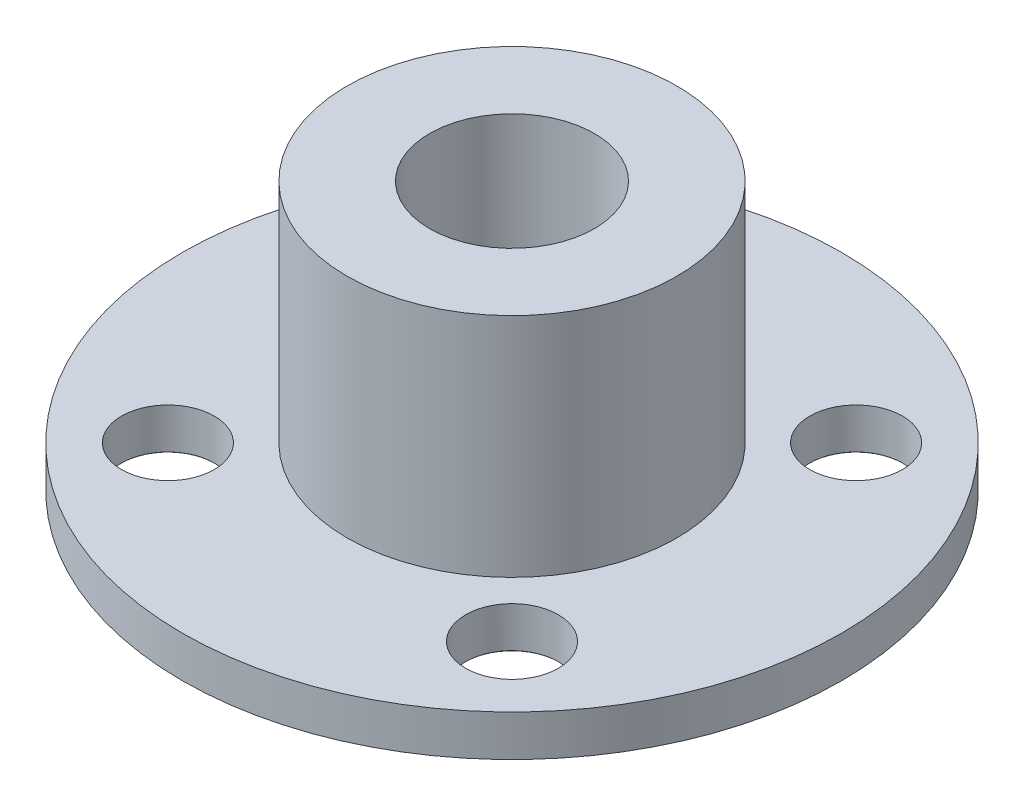
ISO-10303-21;
HEADER;
FILE_DESCRIPTION(('STEP AP214'),'2;1');
FILE_NAME('part.step','',(''),(''),'','','');
FILE_SCHEMA(('AUTOMOTIVE_DESIGN { 1 0 10303 214 1 1 1 1 }'));
ENDSEC;
DATA;
#1=APPLICATION_CONTEXT('core data for automotive mechanical design processes');
#2=APPLICATION_PROTOCOL_DEFINITION('international standard','automotive_design',2000,#1);
#3=PRODUCT_CONTEXT('',#1,'mechanical');
#4=PRODUCT('Part','Part','',(#3));
#5=PRODUCT_RELATED_PRODUCT_CATEGORY('part','',(#4));
#6=PRODUCT_DEFINITION_FORMATION('','',#4);
#7=PRODUCT_DEFINITION_CONTEXT('part definition',#1,'design');
#8=PRODUCT_DEFINITION('design','',#6,#7);
#9=PRODUCT_DEFINITION_SHAPE('','',#8);
#10=(LENGTH_UNIT() NAMED_UNIT(*) SI_UNIT(.MILLI.,.METRE.));
#11=(NAMED_UNIT(*) PLANE_ANGLE_UNIT() SI_UNIT($,.RADIAN.));
#12=(NAMED_UNIT(*) SI_UNIT($,.STERADIAN.) SOLID_ANGLE_UNIT());
#13=UNCERTAINTY_MEASURE_WITH_UNIT(LENGTH_MEASURE(1.E-05),#10,'distance_accuracy_value','');
#14=(GEOMETRIC_REPRESENTATION_CONTEXT(3) GLOBAL_UNCERTAINTY_ASSIGNED_CONTEXT((#13)) GLOBAL_UNIT_ASSIGNED_CONTEXT((#10,
#11,#12)) REPRESENTATION_CONTEXT('',''));
#15=CARTESIAN_POINT('',(0.,0.,0.));
#16=DIRECTION('',(0.,0.,1.));
#17=DIRECTION('',(1.,0.,0.));
#18=AXIS2_PLACEMENT_3D('',#15,#16,#17);
#19=CARTESIAN_POINT('',(0.,2.,0.));
#20=DIRECTION('',(0.,1.,0.));
#21=DIRECTION('',(0.,0.,1.));
#22=AXIS2_PLACEMENT_3D('',#19,#20,#21);
#23=PLANE('',#22);
#24=CARTESIAN_POINT('',(8.35,2.,-8.35));
#25=DIRECTION('',(0.,1.,0.));
#26=DIRECTION('',(0.,0.,1.));
#27=AXIS2_PLACEMENT_3D('',#24,#25,#26);
#28=CIRCLE('',#27,2.24999999999999);
#29=CARTESIAN_POINT('',(8.35,2.,-6.10000000000001));
#30=VERTEX_POINT('',#29);
#31=EDGE_CURVE('E49',#30,#30,#28,.T.);
#32=ORIENTED_EDGE('',*,*,#31,.F.);
#33=EDGE_LOOP('',(#32));
#34=FACE_BOUND('',#33,.T.);
#35=CARTESIAN_POINT('',(-8.35,2.,-8.35));
#36=DIRECTION('',(0.,1.,0.));
#37=DIRECTION('',(0.,0.,1.));
#38=AXIS2_PLACEMENT_3D('',#35,#36,#37);
#39=CIRCLE('',#38,2.24999999999999);
#40=CARTESIAN_POINT('',(-8.35,2.,-6.10000000000001));
#41=VERTEX_POINT('',#40);
#42=EDGE_CURVE('E72',#41,#41,#39,.T.);
#43=ORIENTED_EDGE('',*,*,#42,.F.);
#44=EDGE_LOOP('',(#43));
#45=FACE_BOUND('',#44,.T.);
#46=CARTESIAN_POINT('',(-8.35,2.,8.35));
#47=DIRECTION('',(0.,1.,0.));
#48=DIRECTION('',(0.,0.,1.));
#49=AXIS2_PLACEMENT_3D('',#46,#47,#48);
#50=CIRCLE('',#49,2.24999999999999);
#51=CARTESIAN_POINT('',(-8.35,2.,10.6));
#52=VERTEX_POINT('',#51);
#53=EDGE_CURVE('E68',#52,#52,#50,.T.);
#54=ORIENTED_EDGE('',*,*,#53,.F.);
#55=EDGE_LOOP('',(#54));
#56=FACE_BOUND('',#55,.T.);
#57=CARTESIAN_POINT('',(8.35,2.,8.35));
#58=DIRECTION('',(0.,1.,0.));
#59=DIRECTION('',(0.,0.,1.));
#60=AXIS2_PLACEMENT_3D('',#57,#58,#59);
#61=CIRCLE('',#60,2.24999999999999);
#62=CARTESIAN_POINT('',(8.35,2.,10.6));
#63=VERTEX_POINT('',#62);
#64=EDGE_CURVE('E63',#63,#63,#61,.T.);
#65=ORIENTED_EDGE('',*,*,#64,.F.);
#66=EDGE_LOOP('',(#65));
#67=FACE_BOUND('',#66,.T.);
#68=CARTESIAN_POINT('',(0.,2.,0.));
#69=DIRECTION('',(0.,1.,0.));
#70=DIRECTION('',(0.,0.,1.));
#71=AXIS2_PLACEMENT_3D('',#68,#69,#70);
#72=CIRCLE('',#71,16.);
#73=CARTESIAN_POINT('',(0.,2.,16.));
#74=VERTEX_POINT('',#73);
#75=EDGE_CURVE('E11',#74,#74,#72,.T.);
#76=ORIENTED_EDGE('',*,*,#75,.T.);
#77=EDGE_LOOP('',(#76));
#78=FACE_BOUND('',#77,.T.);
#79=CARTESIAN_POINT('',(0.,2.,0.));
#80=DIRECTION('',(0.,1.,0.));
#81=DIRECTION('',(0.,0.,1.));
#82=AXIS2_PLACEMENT_3D('',#79,#80,#81);
#83=CIRCLE('',#82,8.);
#84=CARTESIAN_POINT('',(0.,2.,8.));
#85=VERTEX_POINT('',#84);
#86=EDGE_CURVE('E97',#85,#85,#83,.T.);
#87=ORIENTED_EDGE('',*,*,#86,.F.);
#88=EDGE_LOOP('',(#87));
#89=FACE_BOUND('',#88,.T.);
#90=ADVANCED_FACE('F45',(#34,#45,#56,#67,#78,#89),#23,.T.);
#91=CARTESIAN_POINT('',(0.,0.,0.));
#92=DIRECTION('',(0.,1.,0.));
#93=DIRECTION('',(0.,0.,1.));
#94=AXIS2_PLACEMENT_3D('',#91,#92,#93);
#95=PLANE('',#94);
#96=CARTESIAN_POINT('',(8.35,0.,-8.35));
#97=DIRECTION('',(0.,-1.,0.));
#98=DIRECTION('',(0.,0.,-1.));
#99=AXIS2_PLACEMENT_3D('',#96,#97,#98);
#100=CIRCLE('',#99,2.275);
#101=CARTESIAN_POINT('',(8.35,0.,-10.625));
#102=VERTEX_POINT('',#101);
#103=EDGE_CURVE('E165',#102,#102,#100,.T.);
#104=ORIENTED_EDGE('',*,*,#103,.F.);
#105=EDGE_LOOP('',(#104));
#106=FACE_BOUND('',#105,.T.);
#107=CARTESIAN_POINT('',(-8.35,0.,-8.35));
#108=DIRECTION('',(0.,-1.,0.));
#109=DIRECTION('',(0.,0.,-1.));
#110=AXIS2_PLACEMENT_3D('',#107,#108,#109);
#111=CIRCLE('',#110,2.275);
#112=CARTESIAN_POINT('',(-8.35,0.,-10.625));
#113=VERTEX_POINT('',#112);
#114=EDGE_CURVE('E81',#113,#113,#111,.T.);
#115=ORIENTED_EDGE('',*,*,#114,.F.);
#116=EDGE_LOOP('',(#115));
#117=FACE_BOUND('',#116,.T.);
#118=CARTESIAN_POINT('',(-8.35,0.,8.35));
#119=DIRECTION('',(0.,-1.,0.));
#120=DIRECTION('',(0.,0.,-1.));
#121=AXIS2_PLACEMENT_3D('',#118,#119,#120);
#122=CIRCLE('',#121,2.275);
#123=CARTESIAN_POINT('',(-8.35,0.,6.075));
#124=VERTEX_POINT('',#123);
#125=EDGE_CURVE('E74',#124,#124,#122,.T.);
#126=ORIENTED_EDGE('',*,*,#125,.F.);
#127=EDGE_LOOP('',(#126));
#128=FACE_BOUND('',#127,.T.);
#129=CARTESIAN_POINT('',(8.35,0.,8.35));
#130=DIRECTION('',(0.,-1.,0.));
#131=DIRECTION('',(0.,0.,-1.));
#132=AXIS2_PLACEMENT_3D('',#129,#130,#131);
#133=CIRCLE('',#132,2.275);
#134=CARTESIAN_POINT('',(8.35,0.,6.075));
#135=VERTEX_POINT('',#134);
#136=EDGE_CURVE('E70',#135,#135,#133,.T.);
#137=ORIENTED_EDGE('',*,*,#136,.F.);
#138=EDGE_LOOP('',(#137));
#139=FACE_BOUND('',#138,.T.);
#140=CARTESIAN_POINT('',(0.,0.,0.));
#141=DIRECTION('',(0.,1.,0.));
#142=DIRECTION('',(0.,0.,1.));
#143=AXIS2_PLACEMENT_3D('',#140,#141,#142);
#144=CIRCLE('',#143,16.);
#145=CARTESIAN_POINT('',(0.,0.,16.));
#146=VERTEX_POINT('',#145);
#147=EDGE_CURVE('E53',#146,#146,#144,.T.);
#148=ORIENTED_EDGE('',*,*,#147,.F.);
#149=EDGE_LOOP('',(#148));
#150=FACE_BOUND('',#149,.T.);
#151=CARTESIAN_POINT('',(0.,0.,0.));
#152=DIRECTION('',(0.,1.,0.));
#153=DIRECTION('',(0.,0.,1.));
#154=AXIS2_PLACEMENT_3D('',#151,#152,#153);
#155=CIRCLE('',#154,4.);
#156=CARTESIAN_POINT('',(0.,0.,4.));
#157=VERTEX_POINT('',#156);
#158=EDGE_CURVE('E58',#157,#157,#155,.T.);
#159=ORIENTED_EDGE('',*,*,#158,.T.);
#160=EDGE_LOOP('',(#159));
#161=FACE_BOUND('',#160,.T.);
#162=ADVANCED_FACE('F106',(#106,#117,#128,#139,#150,#161),#95,.F.);
#163=CARTESIAN_POINT('',(0.,2.,0.));
#164=DIRECTION('',(0.,-1.,0.));
#165=DIRECTION('',(0.,0.,-1.));
#166=AXIS2_PLACEMENT_3D('',#163,#164,#165);
#167=CYLINDRICAL_SURFACE('',#166,16.);
#168=ORIENTED_EDGE('',*,*,#75,.F.);
#169=EDGE_LOOP('',(#168));
#170=FACE_BOUND('',#169,.T.);
#171=ORIENTED_EDGE('',*,*,#147,.T.);
#172=EDGE_LOOP('',(#171));
#173=FACE_BOUND('',#172,.T.);
#174=ADVANCED_FACE('F47',(#170,#173),#167,.T.);
#175=CARTESIAN_POINT('',(0.,2.,0.));
#176=DIRECTION('',(0.,-1.,0.));
#177=DIRECTION('',(0.,0.,-1.));
#178=AXIS2_PLACEMENT_3D('',#175,#176,#177);
#179=CYLINDRICAL_SURFACE('',#178,4.);
#180=ORIENTED_EDGE('',*,*,#158,.F.);
#181=EDGE_LOOP('',(#180));
#182=FACE_BOUND('',#181,.T.);
#183=CARTESIAN_POINT('',(0.,13.,0.));
#184=DIRECTION('',(0.,1.,0.));
#185=DIRECTION('',(0.,0.,1.));
#186=AXIS2_PLACEMENT_3D('',#183,#184,#185);
#187=CIRCLE('',#186,4.);
#188=CARTESIAN_POINT('',(0.,13.,4.));
#189=VERTEX_POINT('',#188);
#190=EDGE_CURVE('E66',#189,#189,#187,.T.);
#191=ORIENTED_EDGE('',*,*,#190,.T.);
#192=EDGE_LOOP('',(#191));
#193=FACE_BOUND('',#192,.T.);
#194=ADVANCED_FACE('F117',(#182,#193),#179,.F.);
#195=CARTESIAN_POINT('',(0.,13.,0.));
#196=DIRECTION('',(0.,1.,0.));
#197=DIRECTION('',(0.,0.,1.));
#198=AXIS2_PLACEMENT_3D('',#195,#196,#197);
#199=PLANE('',#198);
#200=CARTESIAN_POINT('',(0.,13.,0.));
#201=DIRECTION('',(0.,1.,0.));
#202=DIRECTION('',(0.,0.,1.));
#203=AXIS2_PLACEMENT_3D('',#200,#201,#202);
#204=CIRCLE('',#203,8.);
#205=CARTESIAN_POINT('',(0.,13.,8.));
#206=VERTEX_POINT('',#205);
#207=EDGE_CURVE('E98',#206,#206,#204,.T.);
#208=ORIENTED_EDGE('',*,*,#207,.T.);
#209=EDGE_LOOP('',(#208));
#210=FACE_BOUND('',#209,.T.);
#211=ORIENTED_EDGE('',*,*,#190,.F.);
#212=EDGE_LOOP('',(#211));
#213=FACE_BOUND('',#212,.T.);
#214=ADVANCED_FACE('F120',(#210,#213),#199,.T.);
#215=CARTESIAN_POINT('',(0.,13.,0.));
#216=DIRECTION('',(0.,-1.,0.));
#217=DIRECTION('',(0.,0.,-1.));
#218=AXIS2_PLACEMENT_3D('',#215,#216,#217);
#219=CYLINDRICAL_SURFACE('',#218,8.);
#220=ORIENTED_EDGE('',*,*,#207,.F.);
#221=EDGE_LOOP('',(#220));
#222=FACE_BOUND('',#221,.T.);
#223=ORIENTED_EDGE('',*,*,#86,.T.);
#224=EDGE_LOOP('',(#223));
#225=FACE_BOUND('',#224,.T.);
#226=ADVANCED_FACE('F103',(#222,#225),#219,.T.);
#227=CARTESIAN_POINT('',(8.35,0.,8.35));
#228=DIRECTION('',(0.,-1.,0.));
#229=DIRECTION('',(0.,0.,-1.));
#230=AXIS2_PLACEMENT_3D('',#227,#228,#229);
#231=CYLINDRICAL_SURFACE('',#230,2.24999999999999);
#232=ORIENTED_EDGE('',*,*,#64,.T.);
#233=EDGE_LOOP('',(#232));
#234=FACE_BOUND('',#233,.T.);
#235=CARTESIAN_POINT('',(8.35,0.0250000000000111,8.35));
#236=DIRECTION('',(0.,-1.,0.));
#237=DIRECTION('',(0.,0.,-1.));
#238=AXIS2_PLACEMENT_3D('',#235,#236,#237);
#239=CIRCLE('',#238,2.24999999999999);
#240=CARTESIAN_POINT('',(8.35,0.0250000000000111,6.10000000000001));
#241=VERTEX_POINT('',#240);
#242=EDGE_CURVE('E67',#241,#241,#239,.T.);
#243=ORIENTED_EDGE('',*,*,#242,.T.);
#244=EDGE_LOOP('',(#243));
#245=FACE_BOUND('',#244,.T.);
#246=ADVANCED_FACE('F123',(#234,#245),#231,.F.);
#247=CARTESIAN_POINT('',(8.35,0.,8.35));
#248=DIRECTION('',(0.,-1.,0.));
#249=DIRECTION('',(0.,0.,-1.));
#250=AXIS2_PLACEMENT_3D('',#247,#248,#249);
#251=CONICAL_SURFACE('',#250,2.275,0.785398163397379);
#252=ORIENTED_EDGE('',*,*,#242,.F.);
#253=EDGE_LOOP('',(#252));
#254=FACE_BOUND('',#253,.T.);
#255=ORIENTED_EDGE('',*,*,#136,.T.);
#256=EDGE_LOOP('',(#255));
#257=FACE_BOUND('',#256,.T.);
#258=ADVANCED_FACE('F130',(#254,#257),#251,.F.);
#259=CARTESIAN_POINT('',(-8.35,0.,8.35));
#260=DIRECTION('',(0.,-1.,0.));
#261=DIRECTION('',(0.,0.,-1.));
#262=AXIS2_PLACEMENT_3D('',#259,#260,#261);
#263=CYLINDRICAL_SURFACE('',#262,2.24999999999999);
#264=ORIENTED_EDGE('',*,*,#53,.T.);
#265=EDGE_LOOP('',(#264));
#266=FACE_BOUND('',#265,.T.);
#267=CARTESIAN_POINT('',(-8.35,0.0250000000000111,8.35));
#268=DIRECTION('',(0.,-1.,0.));
#269=DIRECTION('',(0.,0.,-1.));
#270=AXIS2_PLACEMENT_3D('',#267,#268,#269);
#271=CIRCLE('',#270,2.24999999999999);
#272=CARTESIAN_POINT('',(-8.35,0.0250000000000111,6.10000000000001));
#273=VERTEX_POINT('',#272);
#274=EDGE_CURVE('E71',#273,#273,#271,.T.);
#275=ORIENTED_EDGE('',*,*,#274,.T.);
#276=EDGE_LOOP('',(#275));
#277=FACE_BOUND('',#276,.T.);
#278=ADVANCED_FACE('F134',(#266,#277),#263,.F.);
#279=CARTESIAN_POINT('',(-8.35,0.,8.35));
#280=DIRECTION('',(0.,-1.,0.));
#281=DIRECTION('',(0.,0.,-1.));
#282=AXIS2_PLACEMENT_3D('',#279,#280,#281);
#283=CONICAL_SURFACE('',#282,2.275,0.785398163397379);
#284=ORIENTED_EDGE('',*,*,#274,.F.);
#285=EDGE_LOOP('',(#284));
#286=FACE_BOUND('',#285,.T.);
#287=ORIENTED_EDGE('',*,*,#125,.T.);
#288=EDGE_LOOP('',(#287));
#289=FACE_BOUND('',#288,.T.);
#290=ADVANCED_FACE('F138',(#286,#289),#283,.F.);
#291=CARTESIAN_POINT('',(-8.35,0.,-8.35));
#292=DIRECTION('',(0.,-1.,0.));
#293=DIRECTION('',(0.,0.,-1.));
#294=AXIS2_PLACEMENT_3D('',#291,#292,#293);
#295=CYLINDRICAL_SURFACE('',#294,2.24999999999999);
#296=ORIENTED_EDGE('',*,*,#42,.T.);
#297=EDGE_LOOP('',(#296));
#298=FACE_BOUND('',#297,.T.);
#299=CARTESIAN_POINT('',(-8.35,0.0250000000000111,-8.35));
#300=DIRECTION('',(0.,-1.,0.));
#301=DIRECTION('',(0.,0.,-1.));
#302=AXIS2_PLACEMENT_3D('',#299,#300,#301);
#303=CIRCLE('',#302,2.24999999999999);
#304=CARTESIAN_POINT('',(-8.35,0.0250000000000111,-10.6));
#305=VERTEX_POINT('',#304);
#306=EDGE_CURVE('E75',#305,#305,#303,.T.);
#307=ORIENTED_EDGE('',*,*,#306,.T.);
#308=EDGE_LOOP('',(#307));
#309=FACE_BOUND('',#308,.T.);
#310=ADVANCED_FACE('F142',(#298,#309),#295,.F.);
#311=CARTESIAN_POINT('',(-8.35,0.,-8.35));
#312=DIRECTION('',(0.,-1.,0.));
#313=DIRECTION('',(0.,0.,-1.));
#314=AXIS2_PLACEMENT_3D('',#311,#312,#313);
#315=CONICAL_SURFACE('',#314,2.275,0.785398163397379);
#316=ORIENTED_EDGE('',*,*,#306,.F.);
#317=EDGE_LOOP('',(#316));
#318=FACE_BOUND('',#317,.T.);
#319=ORIENTED_EDGE('',*,*,#114,.T.);
#320=EDGE_LOOP('',(#319));
#321=FACE_BOUND('',#320,.T.);
#322=ADVANCED_FACE('F146',(#318,#321),#315,.F.);
#323=CARTESIAN_POINT('',(8.35,0.,-8.35));
#324=DIRECTION('',(0.,-1.,0.));
#325=DIRECTION('',(0.,0.,-1.));
#326=AXIS2_PLACEMENT_3D('',#323,#324,#325);
#327=CYLINDRICAL_SURFACE('',#326,2.24999999999999);
#328=ORIENTED_EDGE('',*,*,#31,.T.);
#329=EDGE_LOOP('',(#328));
#330=FACE_BOUND('',#329,.T.);
#331=CARTESIAN_POINT('',(8.35,0.0250000000000111,-8.35));
#332=DIRECTION('',(0.,-1.,0.));
#333=DIRECTION('',(0.,0.,-1.));
#334=AXIS2_PLACEMENT_3D('',#331,#332,#333);
#335=CIRCLE('',#334,2.24999999999999);
#336=CARTESIAN_POINT('',(8.35,0.0250000000000111,-10.6));
#337=VERTEX_POINT('',#336);
#338=EDGE_CURVE('E162',#337,#337,#335,.T.);
#339=ORIENTED_EDGE('',*,*,#338,.T.);
#340=EDGE_LOOP('',(#339));
#341=FACE_BOUND('',#340,.T.);
#342=ADVANCED_FACE('F149',(#330,#341),#327,.F.);
#343=CARTESIAN_POINT('',(8.35,0.,-8.35));
#344=DIRECTION('',(0.,-1.,0.));
#345=DIRECTION('',(0.,0.,-1.));
#346=AXIS2_PLACEMENT_3D('',#343,#344,#345);
#347=CONICAL_SURFACE('',#346,2.275,0.785398163397379);
#348=ORIENTED_EDGE('',*,*,#338,.F.);
#349=EDGE_LOOP('',(#348));
#350=FACE_BOUND('',#349,.T.);
#351=ORIENTED_EDGE('',*,*,#103,.T.);
#352=EDGE_LOOP('',(#351));
#353=FACE_BOUND('',#352,.T.);
#354=ADVANCED_FACE('F153',(#350,#353),#347,.F.);
#355=CLOSED_SHELL('',(#90,#162,#174,#194,#214,#226,#246,#258,#278,#290,#310,#322,#342,#354));
#356=MANIFOLD_SOLID_BREP('B2',#355);
#357=ADVANCED_BREP_SHAPE_REPRESENTATION('',(#18,#356),#14);
#358=SHAPE_DEFINITION_REPRESENTATION(#9,#357);
ENDSEC;
END-ISO-10303-21;
